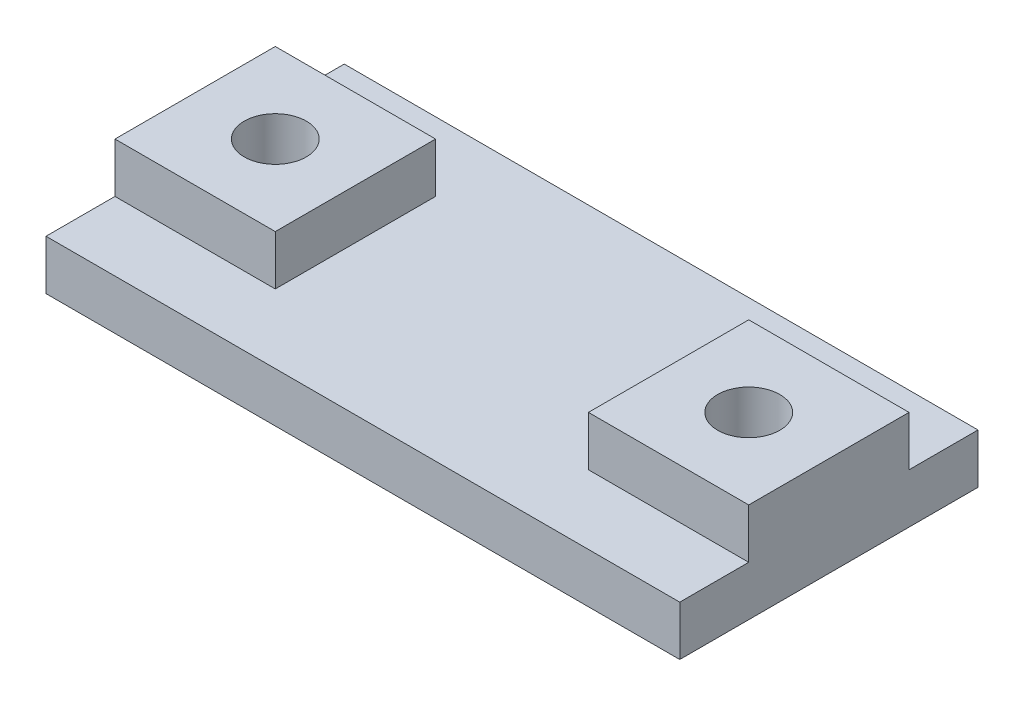
ISO-10303-21;
HEADER;
FILE_DESCRIPTION(('STEP AP214'),'2;1');
FILE_NAME('part.step','',(''),(''),'','','');
FILE_SCHEMA(('AUTOMOTIVE_DESIGN { 1 0 10303 214 1 1 1 1 }'));
ENDSEC;
DATA;
#1=APPLICATION_CONTEXT('core data for automotive mechanical design processes');
#2=APPLICATION_PROTOCOL_DEFINITION('international standard','automotive_design',2000,#1);
#3=PRODUCT_CONTEXT('',#1,'mechanical');
#4=PRODUCT('Part','Part','',(#3));
#5=PRODUCT_RELATED_PRODUCT_CATEGORY('part','',(#4));
#6=PRODUCT_DEFINITION_FORMATION('','',#4);
#7=PRODUCT_DEFINITION_CONTEXT('part definition',#1,'design');
#8=PRODUCT_DEFINITION('design','',#6,#7);
#9=PRODUCT_DEFINITION_SHAPE('','',#8);
#10=(LENGTH_UNIT() NAMED_UNIT(*) SI_UNIT(.MILLI.,.METRE.));
#11=(NAMED_UNIT(*) PLANE_ANGLE_UNIT() SI_UNIT($,.RADIAN.));
#12=(NAMED_UNIT(*) SI_UNIT($,.STERADIAN.) SOLID_ANGLE_UNIT());
#13=UNCERTAINTY_MEASURE_WITH_UNIT(LENGTH_MEASURE(1.E-05),#10,'distance_accuracy_value','');
#14=(GEOMETRIC_REPRESENTATION_CONTEXT(3) GLOBAL_UNCERTAINTY_ASSIGNED_CONTEXT((#13)) GLOBAL_UNIT_ASSIGNED_CONTEXT((#10,
#11,#12)) REPRESENTATION_CONTEXT('',''));
#15=CARTESIAN_POINT('',(0.,0.,0.));
#16=DIRECTION('',(0.,0.,1.));
#17=DIRECTION('',(1.,0.,0.));
#18=AXIS2_PLACEMENT_3D('',#15,#16,#17);
#19=CARTESIAN_POINT('',(0.,4.,0.));
#20=DIRECTION('',(0.,-1.,0.));
#21=DIRECTION('',(0.,0.,-1.));
#22=AXIS2_PLACEMENT_3D('',#19,#20,#21);
#23=PLANE('',#22);
#24=DIRECTION('',(0.,0.,1.));
#25=VECTOR('',#24,1.);
#26=CARTESIAN_POINT('',(-12.75,4.,3.225));
#27=LINE('',#26,#25);
#28=CARTESIAN_POINT('',(-12.75,4.,-3.225));
#29=VERTEX_POINT('',#28);
#30=CARTESIAN_POINT('',(-12.75,4.,3.225));
#31=VERTEX_POINT('',#30);
#32=EDGE_CURVE('E174',#29,#31,#27,.T.);
#33=ORIENTED_EDGE('',*,*,#32,.T.);
#34=DIRECTION('',(1.,0.,0.));
#35=VECTOR('',#34,1.);
#36=CARTESIAN_POINT('',(-12.75,4.,3.225));
#37=LINE('',#36,#35);
#38=CARTESIAN_POINT('',(-6.3,4.,3.225));
#39=VERTEX_POINT('',#38);
#40=EDGE_CURVE('E178',#31,#39,#37,.T.);
#41=ORIENTED_EDGE('',*,*,#40,.T.);
#42=DIRECTION('',(0.,0.,-1.));
#43=VECTOR('',#42,1.);
#44=CARTESIAN_POINT('',(-6.3,4.,3.225));
#45=LINE('',#44,#43);
#46=CARTESIAN_POINT('',(-6.3,4.,-3.225));
#47=VERTEX_POINT('',#46);
#48=EDGE_CURVE('E182',#39,#47,#45,.T.);
#49=ORIENTED_EDGE('',*,*,#48,.T.);
#50=DIRECTION('',(-1.,0.,0.));
#51=VECTOR('',#50,1.);
#52=CARTESIAN_POINT('',(-12.75,4.,-3.225));
#53=LINE('',#52,#51);
#54=EDGE_CURVE('E184',#47,#29,#53,.T.);
#55=ORIENTED_EDGE('',*,*,#54,.T.);
#56=EDGE_LOOP('',(#33,#41,#49,#55));
#57=FACE_BOUND('',#56,.T.);
#58=CARTESIAN_POINT('',(-9.525,4.,0.));
#59=DIRECTION('',(0.,1.,0.));
#60=DIRECTION('',(0.,0.,1.));
#61=AXIS2_PLACEMENT_3D('',#58,#59,#60);
#62=CIRCLE('',#61,1.25);
#63=CARTESIAN_POINT('',(-9.525,4.,1.25));
#64=VERTEX_POINT('',#63);
#65=EDGE_CURVE('E281',#64,#64,#62,.T.);
#66=ORIENTED_EDGE('',*,*,#65,.F.);
#67=EDGE_LOOP('',(#66));
#68=FACE_BOUND('',#67,.T.);
#69=ADVANCED_FACE('F43',(#57,#68),#23,.F.);
#70=CARTESIAN_POINT('',(0.,2.,0.));
#71=DIRECTION('',(0.,-1.,0.));
#72=DIRECTION('',(0.,0.,-1.));
#73=AXIS2_PLACEMENT_3D('',#70,#71,#72);
#74=PLANE('',#73);
#75=DIRECTION('',(-1.,0.,0.));
#76=VECTOR('',#75,1.);
#77=CARTESIAN_POINT('',(12.75,2.,-3.22499999999999));
#78=LINE('',#77,#76);
#79=CARTESIAN_POINT('',(12.75,2.,-3.22499999999999));
#80=VERTEX_POINT('',#79);
#81=CARTESIAN_POINT('',(6.3,2.,-3.225));
#82=VERTEX_POINT('',#81);
#83=EDGE_CURVE('E259',#80,#82,#78,.T.);
#84=ORIENTED_EDGE('',*,*,#83,.F.);
#85=DIRECTION('',(0.,0.,-1.));
#86=VECTOR('',#85,1.);
#87=CARTESIAN_POINT('',(12.75,2.,6.));
#88=LINE('',#87,#86);
#89=CARTESIAN_POINT('',(12.75,2.,-6.));
#90=VERTEX_POINT('',#89);
#91=EDGE_CURVE('E162',#80,#90,#88,.T.);
#92=ORIENTED_EDGE('',*,*,#91,.T.);
#93=DIRECTION('',(-1.,0.,0.));
#94=VECTOR('',#93,1.);
#95=CARTESIAN_POINT('',(-12.75,2.,-6.));
#96=LINE('',#95,#94);
#97=CARTESIAN_POINT('',(-12.75,2.,-6.));
#98=VERTEX_POINT('',#97);
#99=EDGE_CURVE('E208',#90,#98,#96,.T.);
#100=ORIENTED_EDGE('',*,*,#99,.T.);
#101=DIRECTION('',(0.,0.,1.));
#102=VECTOR('',#101,1.);
#103=CARTESIAN_POINT('',(-12.75,2.,6.));
#104=LINE('',#103,#102);
#105=CARTESIAN_POINT('',(-12.75,2.,-3.225));
#106=VERTEX_POINT('',#105);
#107=EDGE_CURVE('E212',#98,#106,#104,.T.);
#108=ORIENTED_EDGE('',*,*,#107,.T.);
#109=DIRECTION('',(-1.,0.,0.));
#110=VECTOR('',#109,1.);
#111=CARTESIAN_POINT('',(-12.75,2.,-3.225));
#112=LINE('',#111,#110);
#113=CARTESIAN_POINT('',(-6.3,2.,-3.225));
#114=VERTEX_POINT('',#113);
#115=EDGE_CURVE('E179',#114,#106,#112,.T.);
#116=ORIENTED_EDGE('',*,*,#115,.F.);
#117=DIRECTION('',(0.,0.,-1.));
#118=VECTOR('',#117,1.);
#119=CARTESIAN_POINT('',(-6.3,2.,3.225));
#120=LINE('',#119,#118);
#121=CARTESIAN_POINT('',(-6.3,2.,3.225));
#122=VERTEX_POINT('',#121);
#123=EDGE_CURVE('E168',#122,#114,#120,.T.);
#124=ORIENTED_EDGE('',*,*,#123,.F.);
#125=DIRECTION('',(1.,0.,0.));
#126=VECTOR('',#125,1.);
#127=CARTESIAN_POINT('',(-12.75,2.,3.225));
#128=LINE('',#127,#126);
#129=CARTESIAN_POINT('',(-12.75,2.,3.225));
#130=VERTEX_POINT('',#129);
#131=EDGE_CURVE('E164',#130,#122,#128,.T.);
#132=ORIENTED_EDGE('',*,*,#131,.F.);
#133=CARTESIAN_POINT('',(-12.75,2.,6.));
#134=VERTEX_POINT('',#133);
#135=EDGE_CURVE('E211',#130,#134,#104,.T.);
#136=ORIENTED_EDGE('',*,*,#135,.T.);
#137=DIRECTION('',(1.,0.,0.));
#138=VECTOR('',#137,1.);
#139=CARTESIAN_POINT('',(-12.75,2.,6.));
#140=LINE('',#139,#138);
#141=CARTESIAN_POINT('',(12.75,2.,6.));
#142=VERTEX_POINT('',#141);
#143=EDGE_CURVE('E214',#134,#142,#140,.T.);
#144=ORIENTED_EDGE('',*,*,#143,.T.);
#145=CARTESIAN_POINT('',(12.75,2.,3.225));
#146=VERTEX_POINT('',#145);
#147=EDGE_CURVE('E205',#142,#146,#88,.T.);
#148=ORIENTED_EDGE('',*,*,#147,.T.);
#149=DIRECTION('',(1.,0.,0.));
#150=VECTOR('',#149,1.);
#151=CARTESIAN_POINT('',(12.75,2.,3.225));
#152=LINE('',#151,#150);
#153=CARTESIAN_POINT('',(6.3,2.,3.225));
#154=VERTEX_POINT('',#153);
#155=EDGE_CURVE('E63',#154,#146,#152,.T.);
#156=ORIENTED_EDGE('',*,*,#155,.F.);
#157=DIRECTION('',(0.,0.,1.));
#158=VECTOR('',#157,1.);
#159=CARTESIAN_POINT('',(6.3,2.,3.225));
#160=LINE('',#159,#158);
#161=EDGE_CURVE('E58',#82,#154,#160,.T.);
#162=ORIENTED_EDGE('',*,*,#161,.F.);
#163=EDGE_LOOP('',(#84,#92,#100,#108,#116,#124,#132,#136,#144,#148,#156,#162));
#164=FACE_BOUND('',#163,.T.);
#165=ADVANCED_FACE('F251',(#164),#74,.F.);
#166=CARTESIAN_POINT('',(12.75,2.,6.));
#167=DIRECTION('',(-1.,0.,0.));
#168=DIRECTION('',(0.,0.,1.));
#169=AXIS2_PLACEMENT_3D('',#166,#167,#168);
#170=PLANE('',#169);
#171=DIRECTION('',(0.,0.,-1.));
#172=VECTOR('',#171,1.);
#173=CARTESIAN_POINT('',(12.75,0.,6.));
#174=LINE('',#173,#172);
#175=CARTESIAN_POINT('',(12.75,0.,6.));
#176=VERTEX_POINT('',#175);
#177=CARTESIAN_POINT('',(12.75,0.,-6.));
#178=VERTEX_POINT('',#177);
#179=EDGE_CURVE('E204',#176,#178,#174,.T.);
#180=ORIENTED_EDGE('',*,*,#179,.T.);
#181=DIRECTION('',(0.,-1.,0.));
#182=VECTOR('',#181,1.);
#183=CARTESIAN_POINT('',(12.75,2.,-6.));
#184=LINE('',#183,#182);
#185=EDGE_CURVE('E11',#90,#178,#184,.T.);
#186=ORIENTED_EDGE('',*,*,#185,.F.);
#187=ORIENTED_EDGE('',*,*,#91,.F.);
#188=DIRECTION('',(0.,-1.,0.));
#189=VECTOR('',#188,1.);
#190=CARTESIAN_POINT('',(12.75,4.,-3.22499999999999));
#191=LINE('',#190,#189);
#192=CARTESIAN_POINT('',(12.75,4.,-3.22499999999999));
#193=VERTEX_POINT('',#192);
#194=EDGE_CURVE('E142',#193,#80,#191,.T.);
#195=ORIENTED_EDGE('',*,*,#194,.F.);
#196=DIRECTION('',(0.,0.,-1.));
#197=VECTOR('',#196,1.);
#198=CARTESIAN_POINT('',(12.75,4.,3.225));
#199=LINE('',#198,#197);
#200=CARTESIAN_POINT('',(12.75,4.,3.225));
#201=VERTEX_POINT('',#200);
#202=EDGE_CURVE('E149',#201,#193,#199,.T.);
#203=ORIENTED_EDGE('',*,*,#202,.F.);
#204=DIRECTION('',(0.,-1.,0.));
#205=VECTOR('',#204,1.);
#206=CARTESIAN_POINT('',(12.75,4.,3.225));
#207=LINE('',#206,#205);
#208=EDGE_CURVE('E250',#201,#146,#207,.T.);
#209=ORIENTED_EDGE('',*,*,#208,.T.);
#210=ORIENTED_EDGE('',*,*,#147,.F.);
#211=DIRECTION('',(0.,-1.,0.));
#212=VECTOR('',#211,1.);
#213=CARTESIAN_POINT('',(12.75,2.,6.));
#214=LINE('',#213,#212);
#215=EDGE_CURVE('E217',#142,#176,#214,.T.);
#216=ORIENTED_EDGE('',*,*,#215,.T.);
#217=EDGE_LOOP('',(#180,#186,#187,#195,#203,#209,#210,#216));
#218=FACE_BOUND('',#217,.T.);
#219=ADVANCED_FACE('F45',(#218),#170,.F.);
#220=CARTESIAN_POINT('',(-12.75,2.,-6.));
#221=DIRECTION('',(0.,0.,1.));
#222=DIRECTION('',(1.,0.,0.));
#223=AXIS2_PLACEMENT_3D('',#220,#221,#222);
#224=PLANE('',#223);
#225=DIRECTION('',(-1.,0.,0.));
#226=VECTOR('',#225,1.);
#227=CARTESIAN_POINT('',(-12.75,0.,-6.));
#228=LINE('',#227,#226);
#229=CARTESIAN_POINT('',(-12.75,0.,-6.));
#230=VERTEX_POINT('',#229);
#231=EDGE_CURVE('E220',#178,#230,#228,.T.);
#232=ORIENTED_EDGE('',*,*,#231,.T.);
#233=DIRECTION('',(0.,-1.,0.));
#234=VECTOR('',#233,1.);
#235=CARTESIAN_POINT('',(-12.75,2.,-6.));
#236=LINE('',#235,#234);
#237=EDGE_CURVE('E51',#98,#230,#236,.T.);
#238=ORIENTED_EDGE('',*,*,#237,.F.);
#239=ORIENTED_EDGE('',*,*,#99,.F.);
#240=ORIENTED_EDGE('',*,*,#185,.T.);
#241=EDGE_LOOP('',(#232,#238,#239,#240));
#242=FACE_BOUND('',#241,.T.);
#243=ADVANCED_FACE('F315',(#242),#224,.F.);
#244=CARTESIAN_POINT('',(-12.75,2.,6.));
#245=DIRECTION('',(1.,0.,0.));
#246=DIRECTION('',(0.,0.,-1.));
#247=AXIS2_PLACEMENT_3D('',#244,#245,#246);
#248=PLANE('',#247);
#249=DIRECTION('',(0.,0.,1.));
#250=VECTOR('',#249,1.);
#251=CARTESIAN_POINT('',(-12.75,0.,6.));
#252=LINE('',#251,#250);
#253=CARTESIAN_POINT('',(-12.75,0.,6.));
#254=VERTEX_POINT('',#253);
#255=EDGE_CURVE('E222',#230,#254,#252,.T.);
#256=ORIENTED_EDGE('',*,*,#255,.T.);
#257=DIRECTION('',(0.,-1.,0.));
#258=VECTOR('',#257,1.);
#259=CARTESIAN_POINT('',(-12.75,2.,6.));
#260=LINE('',#259,#258);
#261=EDGE_CURVE('E230',#134,#254,#260,.T.);
#262=ORIENTED_EDGE('',*,*,#261,.F.);
#263=ORIENTED_EDGE('',*,*,#135,.F.);
#264=DIRECTION('',(0.,-1.,0.));
#265=VECTOR('',#264,1.);
#266=CARTESIAN_POINT('',(-12.75,4.,3.225));
#267=LINE('',#266,#265);
#268=EDGE_CURVE('E200',#31,#130,#267,.T.);
#269=ORIENTED_EDGE('',*,*,#268,.F.);
#270=ORIENTED_EDGE('',*,*,#32,.F.);
#271=DIRECTION('',(0.,-1.,0.));
#272=VECTOR('',#271,1.);
#273=CARTESIAN_POINT('',(-12.75,4.,-3.225));
#274=LINE('',#273,#272);
#275=EDGE_CURVE('E185',#29,#106,#274,.T.);
#276=ORIENTED_EDGE('',*,*,#275,.T.);
#277=ORIENTED_EDGE('',*,*,#107,.F.);
#278=ORIENTED_EDGE('',*,*,#237,.T.);
#279=EDGE_LOOP('',(#256,#262,#263,#269,#270,#276,#277,#278));
#280=FACE_BOUND('',#279,.T.);
#281=ADVANCED_FACE('F237',(#280),#248,.F.);
#282=CARTESIAN_POINT('',(-12.75,2.,6.));
#283=DIRECTION('',(0.,0.,-1.));
#284=DIRECTION('',(-1.,0.,0.));
#285=AXIS2_PLACEMENT_3D('',#282,#283,#284);
#286=PLANE('',#285);
#287=DIRECTION('',(1.,0.,0.));
#288=VECTOR('',#287,1.);
#289=CARTESIAN_POINT('',(-12.75,0.,6.));
#290=LINE('',#289,#288);
#291=EDGE_CURVE('E224',#254,#176,#290,.T.);
#292=ORIENTED_EDGE('',*,*,#291,.T.);
#293=ORIENTED_EDGE('',*,*,#215,.F.);
#294=ORIENTED_EDGE('',*,*,#143,.F.);
#295=ORIENTED_EDGE('',*,*,#261,.T.);
#296=EDGE_LOOP('',(#292,#293,#294,#295));
#297=FACE_BOUND('',#296,.T.);
#298=ADVANCED_FACE('F247',(#297),#286,.F.);
#299=CARTESIAN_POINT('',(0.,0.,0.));
#300=DIRECTION('',(0.,-1.,0.));
#301=DIRECTION('',(0.,0.,-1.));
#302=AXIS2_PLACEMENT_3D('',#299,#300,#301);
#303=PLANE('',#302);
#304=CARTESIAN_POINT('',(-9.525,0.,0.));
#305=DIRECTION('',(0.,1.,0.));
#306=DIRECTION('',(0.,0.,1.));
#307=AXIS2_PLACEMENT_3D('',#304,#305,#306);
#308=CIRCLE('',#307,1.25);
#309=CARTESIAN_POINT('',(-9.525,0.,1.25));
#310=VERTEX_POINT('',#309);
#311=EDGE_CURVE('E275',#310,#310,#308,.T.);
#312=ORIENTED_EDGE('',*,*,#311,.T.);
#313=EDGE_LOOP('',(#312));
#314=FACE_BOUND('',#313,.T.);
#315=CARTESIAN_POINT('',(9.525,0.,0.));
#316=DIRECTION('',(0.,1.,0.));
#317=DIRECTION('',(0.,0.,1.));
#318=AXIS2_PLACEMENT_3D('',#315,#316,#317);
#319=CIRCLE('',#318,1.25);
#320=CARTESIAN_POINT('',(9.525,0.,1.25));
#321=VERTEX_POINT('',#320);
#322=EDGE_CURVE('E267',#321,#321,#319,.T.);
#323=ORIENTED_EDGE('',*,*,#322,.T.);
#324=EDGE_LOOP('',(#323));
#325=FACE_BOUND('',#324,.T.);
#326=ORIENTED_EDGE('',*,*,#179,.F.);
#327=ORIENTED_EDGE('',*,*,#291,.F.);
#328=ORIENTED_EDGE('',*,*,#255,.F.);
#329=ORIENTED_EDGE('',*,*,#231,.F.);
#330=EDGE_LOOP('',(#326,#327,#328,#329));
#331=FACE_BOUND('',#330,.T.);
#332=ADVANCED_FACE('F244',(#314,#325,#331),#303,.T.);
#333=CARTESIAN_POINT('',(-12.75,4.,3.225));
#334=DIRECTION('',(0.,0.,-1.));
#335=DIRECTION('',(-1.,0.,0.));
#336=AXIS2_PLACEMENT_3D('',#333,#334,#335);
#337=PLANE('',#336);
#338=ORIENTED_EDGE('',*,*,#131,.T.);
#339=DIRECTION('',(0.,-1.,0.));
#340=VECTOR('',#339,1.);
#341=CARTESIAN_POINT('',(-6.3,4.,3.225));
#342=LINE('',#341,#340);
#343=EDGE_CURVE('E197',#39,#122,#342,.T.);
#344=ORIENTED_EDGE('',*,*,#343,.F.);
#345=ORIENTED_EDGE('',*,*,#40,.F.);
#346=ORIENTED_EDGE('',*,*,#268,.T.);
#347=EDGE_LOOP('',(#338,#344,#345,#346));
#348=FACE_BOUND('',#347,.T.);
#349=ADVANCED_FACE('F304',(#348),#337,.F.);
#350=CARTESIAN_POINT('',(-6.3,4.,3.225));
#351=DIRECTION('',(-1.,0.,0.));
#352=DIRECTION('',(0.,0.,1.));
#353=AXIS2_PLACEMENT_3D('',#350,#351,#352);
#354=PLANE('',#353);
#355=ORIENTED_EDGE('',*,*,#123,.T.);
#356=DIRECTION('',(0.,-1.,0.));
#357=VECTOR('',#356,1.);
#358=CARTESIAN_POINT('',(-6.3,4.,-3.225));
#359=LINE('',#358,#357);
#360=EDGE_CURVE('E194',#47,#114,#359,.T.);
#361=ORIENTED_EDGE('',*,*,#360,.F.);
#362=ORIENTED_EDGE('',*,*,#48,.F.);
#363=ORIENTED_EDGE('',*,*,#343,.T.);
#364=EDGE_LOOP('',(#355,#361,#362,#363));
#365=FACE_BOUND('',#364,.T.);
#366=ADVANCED_FACE('F300',(#365),#354,.F.);
#367=CARTESIAN_POINT('',(-12.75,4.,-3.225));
#368=DIRECTION('',(0.,0.,1.));
#369=DIRECTION('',(1.,0.,0.));
#370=AXIS2_PLACEMENT_3D('',#367,#368,#369);
#371=PLANE('',#370);
#372=ORIENTED_EDGE('',*,*,#115,.T.);
#373=ORIENTED_EDGE('',*,*,#275,.F.);
#374=ORIENTED_EDGE('',*,*,#54,.F.);
#375=ORIENTED_EDGE('',*,*,#360,.T.);
#376=EDGE_LOOP('',(#372,#373,#374,#375));
#377=FACE_BOUND('',#376,.T.);
#378=ADVANCED_FACE('F297',(#377),#371,.F.);
#379=CARTESIAN_POINT('',(12.75,4.,-3.22499999999999));
#380=DIRECTION('',(0.,0.,1.));
#381=DIRECTION('',(1.,0.,0.));
#382=AXIS2_PLACEMENT_3D('',#379,#380,#381);
#383=PLANE('',#382);
#384=ORIENTED_EDGE('',*,*,#83,.T.);
#385=DIRECTION('',(0.,-1.,0.));
#386=VECTOR('',#385,1.);
#387=CARTESIAN_POINT('',(6.3,4.,-3.225));
#388=LINE('',#387,#386);
#389=CARTESIAN_POINT('',(6.3,4.,-3.225));
#390=VERTEX_POINT('',#389);
#391=EDGE_CURVE('E144',#390,#82,#388,.T.);
#392=ORIENTED_EDGE('',*,*,#391,.F.);
#393=DIRECTION('',(-1.,0.,0.));
#394=VECTOR('',#393,1.);
#395=CARTESIAN_POINT('',(12.75,4.,-3.22499999999999));
#396=LINE('',#395,#394);
#397=EDGE_CURVE('E138',#193,#390,#396,.T.);
#398=ORIENTED_EDGE('',*,*,#397,.F.);
#399=ORIENTED_EDGE('',*,*,#194,.T.);
#400=EDGE_LOOP('',(#384,#392,#398,#399));
#401=FACE_BOUND('',#400,.T.);
#402=ADVANCED_FACE('F140',(#401),#383,.F.);
#403=CARTESIAN_POINT('',(6.3,4.,3.225));
#404=DIRECTION('',(1.,0.,0.));
#405=DIRECTION('',(0.,0.,-1.));
#406=AXIS2_PLACEMENT_3D('',#403,#404,#405);
#407=PLANE('',#406);
#408=ORIENTED_EDGE('',*,*,#161,.T.);
#409=DIRECTION('',(0.,-1.,0.));
#410=VECTOR('',#409,1.);
#411=CARTESIAN_POINT('',(6.3,4.,3.225));
#412=LINE('',#411,#410);
#413=CARTESIAN_POINT('',(6.3,4.,3.225));
#414=VERTEX_POINT('',#413);
#415=EDGE_CURVE('E170',#414,#154,#412,.T.);
#416=ORIENTED_EDGE('',*,*,#415,.F.);
#417=DIRECTION('',(0.,0.,1.));
#418=VECTOR('',#417,1.);
#419=CARTESIAN_POINT('',(6.3,4.,3.225));
#420=LINE('',#419,#418);
#421=EDGE_CURVE('E148',#390,#414,#420,.T.);
#422=ORIENTED_EDGE('',*,*,#421,.F.);
#423=ORIENTED_EDGE('',*,*,#391,.T.);
#424=EDGE_LOOP('',(#408,#416,#422,#423));
#425=FACE_BOUND('',#424,.T.);
#426=ADVANCED_FACE('F374',(#425),#407,.F.);
#427=CARTESIAN_POINT('',(12.75,4.,3.225));
#428=DIRECTION('',(0.,0.,-1.));
#429=DIRECTION('',(-1.,0.,0.));
#430=AXIS2_PLACEMENT_3D('',#427,#428,#429);
#431=PLANE('',#430);
#432=ORIENTED_EDGE('',*,*,#155,.T.);
#433=ORIENTED_EDGE('',*,*,#208,.F.);
#434=DIRECTION('',(1.,0.,0.));
#435=VECTOR('',#434,1.);
#436=CARTESIAN_POINT('',(12.75,4.,3.225));
#437=LINE('',#436,#435);
#438=EDGE_CURVE('E154',#414,#201,#437,.T.);
#439=ORIENTED_EDGE('',*,*,#438,.F.);
#440=ORIENTED_EDGE('',*,*,#415,.T.);
#441=EDGE_LOOP('',(#432,#433,#439,#440));
#442=FACE_BOUND('',#441,.T.);
#443=ADVANCED_FACE('F254',(#442),#431,.F.);
#444=CARTESIAN_POINT('',(0.,4.,0.));
#445=DIRECTION('',(0.,1.,0.));
#446=DIRECTION('',(0.,0.,1.));
#447=AXIS2_PLACEMENT_3D('',#444,#445,#446);
#448=PLANE('',#447);
#449=CARTESIAN_POINT('',(9.525,4.,0.));
#450=DIRECTION('',(0.,1.,0.));
#451=DIRECTION('',(0.,0.,1.));
#452=AXIS2_PLACEMENT_3D('',#449,#450,#451);
#453=CIRCLE('',#452,1.25);
#454=CARTESIAN_POINT('',(9.525,4.,1.25));
#455=VERTEX_POINT('',#454);
#456=EDGE_CURVE('E270',#455,#455,#453,.T.);
#457=ORIENTED_EDGE('',*,*,#456,.F.);
#458=EDGE_LOOP('',(#457));
#459=FACE_BOUND('',#458,.T.);
#460=ORIENTED_EDGE('',*,*,#202,.T.);
#461=ORIENTED_EDGE('',*,*,#397,.T.);
#462=ORIENTED_EDGE('',*,*,#421,.T.);
#463=ORIENTED_EDGE('',*,*,#438,.T.);
#464=EDGE_LOOP('',(#460,#461,#462,#463));
#465=FACE_BOUND('',#464,.T.);
#466=ADVANCED_FACE('F152',(#459,#465),#448,.T.);
#467=CARTESIAN_POINT('',(9.525,4.,0.));
#468=DIRECTION('',(0.,1.,0.));
#469=DIRECTION('',(0.,0.,1.));
#470=AXIS2_PLACEMENT_3D('',#467,#468,#469);
#471=CYLINDRICAL_SURFACE('',#470,1.25);
#472=ORIENTED_EDGE('',*,*,#322,.F.);
#473=EDGE_LOOP('',(#472));
#474=FACE_BOUND('',#473,.T.);
#475=ORIENTED_EDGE('',*,*,#456,.T.);
#476=EDGE_LOOP('',(#475));
#477=FACE_BOUND('',#476,.T.);
#478=ADVANCED_FACE('F344',(#474,#477),#471,.F.);
#479=CARTESIAN_POINT('',(-9.525,4.,0.));
#480=DIRECTION('',(0.,1.,0.));
#481=DIRECTION('',(0.,0.,1.));
#482=AXIS2_PLACEMENT_3D('',#479,#480,#481);
#483=CYLINDRICAL_SURFACE('',#482,1.25);
#484=ORIENTED_EDGE('',*,*,#311,.F.);
#485=EDGE_LOOP('',(#484));
#486=FACE_BOUND('',#485,.T.);
#487=ORIENTED_EDGE('',*,*,#65,.T.);
#488=EDGE_LOOP('',(#487));
#489=FACE_BOUND('',#488,.T.);
#490=ADVANCED_FACE('F285',(#486,#489),#483,.F.);
#491=CLOSED_SHELL('',(#69,#165,#219,#243,#281,#298,#332,#349,#366,#378,#402,#426,#443,#466,#478,#490));
#492=MANIFOLD_SOLID_BREP('B2',#491);
#493=ADVANCED_BREP_SHAPE_REPRESENTATION('',(#18,#492),#14);
#494=SHAPE_DEFINITION_REPRESENTATION(#9,#493);
ENDSEC;
END-ISO-10303-21;
